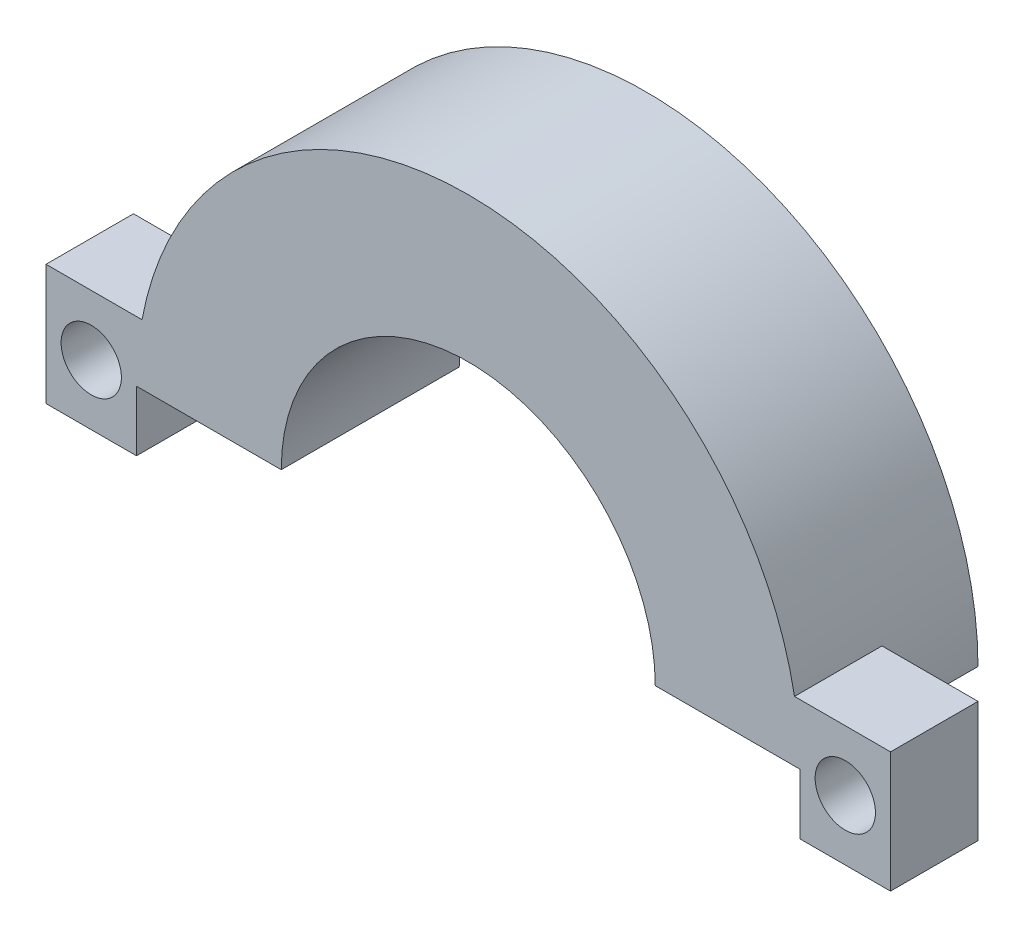
ISO-10303-21;
HEADER;
FILE_DESCRIPTION(('STEP AP214'),'2;1');
FILE_NAME('part.step','',(''),(''),'','','');
FILE_SCHEMA(('AUTOMOTIVE_DESIGN { 1 0 10303 214 1 1 1 1 }'));
ENDSEC;
DATA;
#1=APPLICATION_CONTEXT('core data for automotive mechanical design processes');
#2=APPLICATION_PROTOCOL_DEFINITION('international standard','automotive_design',2000,#1);
#3=PRODUCT_CONTEXT('',#1,'mechanical');
#4=PRODUCT('Part','Part','',(#3));
#5=PRODUCT_RELATED_PRODUCT_CATEGORY('part','',(#4));
#6=PRODUCT_DEFINITION_FORMATION('','',#4);
#7=PRODUCT_DEFINITION_CONTEXT('part definition',#1,'design');
#8=PRODUCT_DEFINITION('design','',#6,#7);
#9=PRODUCT_DEFINITION_SHAPE('','',#8);
#10=(LENGTH_UNIT() NAMED_UNIT(*) SI_UNIT(.MILLI.,.METRE.));
#11=(NAMED_UNIT(*) PLANE_ANGLE_UNIT() SI_UNIT($,.RADIAN.));
#12=(NAMED_UNIT(*) SI_UNIT($,.STERADIAN.) SOLID_ANGLE_UNIT());
#13=UNCERTAINTY_MEASURE_WITH_UNIT(LENGTH_MEASURE(1.E-05),#10,'distance_accuracy_value','');
#14=(GEOMETRIC_REPRESENTATION_CONTEXT(3) GLOBAL_UNCERTAINTY_ASSIGNED_CONTEXT((#13)) GLOBAL_UNIT_ASSIGNED_CONTEXT((#10,
#11,#12)) REPRESENTATION_CONTEXT('',''));
#15=CARTESIAN_POINT('',(0.,0.,0.));
#16=DIRECTION('',(0.,0.,1.));
#17=DIRECTION('',(1.,0.,0.));
#18=AXIS2_PLACEMENT_3D('',#15,#16,#17);
#19=CARTESIAN_POINT('',(7.56323897211495,0.,5.9));
#20=DIRECTION('',(0.,0.,-1.));
#21=DIRECTION('',(-1.,0.,0.));
#22=AXIS2_PLACEMENT_3D('',#19,#20,#21);
#23=CYLINDRICAL_SURFACE('',#22,11.);
#24=CARTESIAN_POINT('',(7.56323897211495,0.,5.9));
#25=DIRECTION('',(0.,0.,1.));
#26=DIRECTION('',(1.,0.,0.));
#27=AXIS2_PLACEMENT_3D('',#24,#25,#26);
#28=CIRCLE('',#27,11.);
#29=CARTESIAN_POINT('',(-3.25341485427702,2.,5.9));
#30=VERTEX_POINT('',#29);
#31=CARTESIAN_POINT('',(18.3798927985069,2.,5.9));
#32=VERTEX_POINT('',#31);
#33=EDGE_CURVE('E66',#30,#32,#28,.F.);
#34=ORIENTED_EDGE('',*,*,#33,.T.);
#35=DIRECTION('',(0.,0.,-1.));
#36=VECTOR('',#35,1.);
#37=CARTESIAN_POINT('',(18.3798927985069,2.,5.9));
#38=LINE('',#37,#36);
#39=CARTESIAN_POINT('',(18.3798927985069,2.,3.));
#40=VERTEX_POINT('',#39);
#41=EDGE_CURVE('E61',#32,#40,#38,.T.);
#42=ORIENTED_EDGE('',*,*,#41,.T.);
#43=CARTESIAN_POINT('',(7.56323897211495,0.,3.));
#44=DIRECTION('',(0.,0.,1.));
#45=DIRECTION('',(1.,0.,0.));
#46=AXIS2_PLACEMENT_3D('',#43,#44,#45);
#47=CIRCLE('',#46,11.);
#48=CARTESIAN_POINT('',(18.563238972115,0.,3.));
#49=VERTEX_POINT('',#48);
#50=EDGE_CURVE('E146',#40,#49,#47,.F.);
#51=ORIENTED_EDGE('',*,*,#50,.T.);
#52=DIRECTION('',(0.,0.,-1.));
#53=VECTOR('',#52,1.);
#54=CARTESIAN_POINT('',(18.563238972115,0.,5.9));
#55=LINE('',#54,#53);
#56=CARTESIAN_POINT('',(18.563238972115,0.,0.));
#57=VERTEX_POINT('',#56);
#58=EDGE_CURVE('E235',#49,#57,#55,.T.);
#59=ORIENTED_EDGE('',*,*,#58,.T.);
#60=CARTESIAN_POINT('',(7.56323897211495,0.,0.));
#61=DIRECTION('',(0.,0.,1.));
#62=DIRECTION('',(1.,0.,0.));
#63=AXIS2_PLACEMENT_3D('',#60,#61,#62);
#64=CIRCLE('',#63,11.);
#65=CARTESIAN_POINT('',(-3.43676102788505,0.,0.));
#66=VERTEX_POINT('',#65);
#67=EDGE_CURVE('E220',#66,#57,#64,.F.);
#68=ORIENTED_EDGE('',*,*,#67,.F.);
#69=DIRECTION('',(0.,0.,-1.));
#70=VECTOR('',#69,1.);
#71=CARTESIAN_POINT('',(-3.43676102788505,0.,5.9));
#72=LINE('',#71,#70);
#73=CARTESIAN_POINT('',(-3.43676102788505,0.,3.));
#74=VERTEX_POINT('',#73);
#75=EDGE_CURVE('E224',#74,#66,#72,.T.);
#76=ORIENTED_EDGE('',*,*,#75,.F.);
#77=CARTESIAN_POINT('',(7.56323897211495,0.,3.));
#78=DIRECTION('',(0.,0.,1.));
#79=DIRECTION('',(1.,0.,0.));
#80=AXIS2_PLACEMENT_3D('',#77,#78,#79);
#81=CIRCLE('',#80,11.);
#82=CARTESIAN_POINT('',(-3.25341485427702,2.,3.));
#83=VERTEX_POINT('',#82);
#84=EDGE_CURVE('E11',#74,#83,#81,.F.);
#85=ORIENTED_EDGE('',*,*,#84,.T.);
#86=DIRECTION('',(0.,0.,-1.));
#87=VECTOR('',#86,1.);
#88=CARTESIAN_POINT('',(-3.25341485427702,2.,5.9));
#89=LINE('',#88,#87);
#90=EDGE_CURVE('E211',#83,#30,#89,.F.);
#91=ORIENTED_EDGE('',*,*,#90,.T.);
#92=EDGE_LOOP('',(#34,#42,#51,#59,#68,#76,#85,#91));
#93=FACE_BOUND('',#92,.T.);
#94=ADVANCED_FACE('F44',(#93),#23,.T.);
#95=CARTESIAN_POINT('',(0.,0.,5.9));
#96=DIRECTION('',(0.,1.,0.));
#97=DIRECTION('',(0.,0.,1.));
#98=AXIS2_PLACEMENT_3D('',#95,#96,#97);
#99=PLANE('',#98);
#100=DIRECTION('',(0.,0.,-1.));
#101=VECTOR('',#100,1.);
#102=CARTESIAN_POINT('',(1.36323897211495,0.,5.9));
#103=LINE('',#102,#101);
#104=CARTESIAN_POINT('',(1.36323897211495,0.,5.9));
#105=VERTEX_POINT('',#104);
#106=CARTESIAN_POINT('',(1.36323897211495,0.,0.));
#107=VERTEX_POINT('',#106);
#108=EDGE_CURVE('E53',#105,#107,#103,.T.);
#109=ORIENTED_EDGE('',*,*,#108,.F.);
#110=DIRECTION('',(1.,0.,0.));
#111=VECTOR('',#110,1.);
#112=CARTESIAN_POINT('',(0.,0.,5.9));
#113=LINE('',#112,#111);
#114=CARTESIAN_POINT('',(-3.43676102788505,0.,5.9));
#115=VERTEX_POINT('',#114);
#116=EDGE_CURVE('E217',#115,#105,#113,.T.);
#117=ORIENTED_EDGE('',*,*,#116,.F.);
#118=EDGE_CURVE('E232',#115,#74,#72,.T.);
#119=ORIENTED_EDGE('',*,*,#118,.T.);
#120=ORIENTED_EDGE('',*,*,#75,.T.);
#121=DIRECTION('',(1.,0.,0.));
#122=VECTOR('',#121,1.);
#123=CARTESIAN_POINT('',(0.,0.,0.));
#124=LINE('',#123,#122);
#125=EDGE_CURVE('E216',#66,#107,#124,.T.);
#126=ORIENTED_EDGE('',*,*,#125,.T.);
#127=EDGE_LOOP('',(#109,#117,#119,#120,#126));
#128=FACE_BOUND('',#127,.T.);
#129=ADVANCED_FACE('F299',(#128),#99,.F.);
#130=CARTESIAN_POINT('',(7.56323897211495,0.,5.9));
#131=DIRECTION('',(0.,0.,-1.));
#132=DIRECTION('',(-1.,0.,0.));
#133=AXIS2_PLACEMENT_3D('',#130,#131,#132);
#134=CYLINDRICAL_SURFACE('',#133,6.2);
#135=CARTESIAN_POINT('',(7.56323897211495,0.,0.));
#136=DIRECTION('',(0.,0.,1.));
#137=DIRECTION('',(1.,0.,0.));
#138=AXIS2_PLACEMENT_3D('',#135,#136,#137);
#139=CIRCLE('',#138,6.2);
#140=CARTESIAN_POINT('',(13.763238972115,0.,0.));
#141=VERTEX_POINT('',#140);
#142=EDGE_CURVE('E227',#107,#141,#139,.F.);
#143=ORIENTED_EDGE('',*,*,#142,.T.);
#144=DIRECTION('',(0.,0.,-1.));
#145=VECTOR('',#144,1.);
#146=CARTESIAN_POINT('',(13.763238972115,0.,5.9));
#147=LINE('',#146,#145);
#148=CARTESIAN_POINT('',(13.763238972115,0.,5.9));
#149=VERTEX_POINT('',#148);
#150=EDGE_CURVE('E239',#149,#141,#147,.T.);
#151=ORIENTED_EDGE('',*,*,#150,.F.);
#152=CARTESIAN_POINT('',(7.56323897211495,0.,5.9));
#153=DIRECTION('',(0.,0.,1.));
#154=DIRECTION('',(1.,0.,0.));
#155=AXIS2_PLACEMENT_3D('',#152,#153,#154);
#156=CIRCLE('',#155,6.2);
#157=EDGE_CURVE('E219',#105,#149,#156,.F.);
#158=ORIENTED_EDGE('',*,*,#157,.F.);
#159=ORIENTED_EDGE('',*,*,#108,.T.);
#160=EDGE_LOOP('',(#143,#151,#158,#159));
#161=FACE_BOUND('',#160,.T.);
#162=ADVANCED_FACE('F46',(#161),#134,.F.);
#163=CARTESIAN_POINT('',(18.563238972115,0.,5.9));
#164=VERTEX_POINT('',#163);
#165=EDGE_CURVE('E236',#164,#49,#55,.T.);
#166=ORIENTED_EDGE('',*,*,#165,.F.);
#167=EDGE_CURVE('E221',#149,#164,#113,.T.);
#168=ORIENTED_EDGE('',*,*,#167,.F.);
#169=ORIENTED_EDGE('',*,*,#150,.T.);
#170=EDGE_CURVE('E228',#141,#57,#124,.T.);
#171=ORIENTED_EDGE('',*,*,#170,.T.);
#172=ORIENTED_EDGE('',*,*,#58,.F.);
#173=EDGE_LOOP('',(#166,#168,#169,#171,#172));
#174=FACE_BOUND('',#173,.T.);
#175=ADVANCED_FACE('F262',(#174),#99,.F.);
#176=CARTESIAN_POINT('',(0.,0.,5.9));
#177=DIRECTION('',(0.,0.,1.));
#178=DIRECTION('',(1.,0.,0.));
#179=AXIS2_PLACEMENT_3D('',#176,#177,#178);
#180=PLANE('',#179);
#181=CARTESIAN_POINT('',(20.063238972115,0.,5.9));
#182=DIRECTION('',(0.,0.,1.));
#183=DIRECTION('',(1.,0.,0.));
#184=AXIS2_PLACEMENT_3D('',#181,#182,#183);
#185=CIRCLE('',#184,1.);
#186=CARTESIAN_POINT('',(21.063238972115,0.,5.9));
#187=VERTEX_POINT('',#186);
#188=EDGE_CURVE('E245',#187,#187,#185,.T.);
#189=ORIENTED_EDGE('',*,*,#188,.F.);
#190=EDGE_LOOP('',(#189));
#191=FACE_BOUND('',#190,.T.);
#192=CARTESIAN_POINT('',(-4.93676102788505,0.,5.9));
#193=DIRECTION('',(0.,0.,1.));
#194=DIRECTION('',(1.,0.,0.));
#195=AXIS2_PLACEMENT_3D('',#192,#193,#194);
#196=CIRCLE('',#195,1.);
#197=CARTESIAN_POINT('',(-3.93676102788505,0.,5.9));
#198=VERTEX_POINT('',#197);
#199=EDGE_CURVE('E170',#198,#198,#196,.T.);
#200=ORIENTED_EDGE('',*,*,#199,.F.);
#201=EDGE_LOOP('',(#200));
#202=FACE_BOUND('',#201,.T.);
#203=ORIENTED_EDGE('',*,*,#167,.T.);
#204=DIRECTION('',(0.,-1.,0.));
#205=VECTOR('',#204,1.);
#206=CARTESIAN_POINT('',(18.563238972115,0.,5.9));
#207=LINE('',#206,#205);
#208=CARTESIAN_POINT('',(18.563238972115,-2.,5.9));
#209=VERTEX_POINT('',#208);
#210=EDGE_CURVE('E167',#164,#209,#207,.T.);
#211=ORIENTED_EDGE('',*,*,#210,.T.);
#212=DIRECTION('',(1.,0.,0.));
#213=VECTOR('',#212,1.);
#214=CARTESIAN_POINT('',(0.,-2.,5.9));
#215=LINE('',#214,#213);
#216=CARTESIAN_POINT('',(21.563238972115,-2.,5.9));
#217=VERTEX_POINT('',#216);
#218=EDGE_CURVE('E164',#209,#217,#215,.T.);
#219=ORIENTED_EDGE('',*,*,#218,.T.);
#220=DIRECTION('',(0.,-1.,0.));
#221=VECTOR('',#220,1.);
#222=CARTESIAN_POINT('',(21.563238972115,0.,5.9));
#223=LINE('',#222,#221);
#224=CARTESIAN_POINT('',(21.563238972115,2.,5.9));
#225=VERTEX_POINT('',#224);
#226=EDGE_CURVE('E176',#225,#217,#223,.T.);
#227=ORIENTED_EDGE('',*,*,#226,.F.);
#228=DIRECTION('',(1.,0.,0.));
#229=VECTOR('',#228,1.);
#230=CARTESIAN_POINT('',(0.,2.,5.9));
#231=LINE('',#230,#229);
#232=EDGE_CURVE('E154',#32,#225,#231,.T.);
#233=ORIENTED_EDGE('',*,*,#232,.F.);
#234=ORIENTED_EDGE('',*,*,#33,.F.);
#235=DIRECTION('',(1.,0.,0.));
#236=VECTOR('',#235,1.);
#237=CARTESIAN_POINT('',(0.,2.,5.9));
#238=LINE('',#237,#236);
#239=CARTESIAN_POINT('',(-6.43676102788505,2.,5.9));
#240=VERTEX_POINT('',#239);
#241=EDGE_CURVE('E190',#240,#30,#238,.T.);
#242=ORIENTED_EDGE('',*,*,#241,.F.);
#243=DIRECTION('',(0.,-1.,0.));
#244=VECTOR('',#243,1.);
#245=CARTESIAN_POINT('',(-6.43676102788505,0.,5.9));
#246=LINE('',#245,#244);
#247=CARTESIAN_POINT('',(-6.43676102788505,-2.,5.9));
#248=VERTEX_POINT('',#247);
#249=EDGE_CURVE('E185',#240,#248,#246,.T.);
#250=ORIENTED_EDGE('',*,*,#249,.T.);
#251=DIRECTION('',(1.,0.,0.));
#252=VECTOR('',#251,1.);
#253=CARTESIAN_POINT('',(0.,-2.,5.9));
#254=LINE('',#253,#252);
#255=CARTESIAN_POINT('',(-3.43676102788505,-2.,5.9));
#256=VERTEX_POINT('',#255);
#257=EDGE_CURVE('E201',#248,#256,#254,.T.);
#258=ORIENTED_EDGE('',*,*,#257,.T.);
#259=DIRECTION('',(0.,-1.,0.));
#260=VECTOR('',#259,1.);
#261=CARTESIAN_POINT('',(-3.43676102788505,0.,5.9));
#262=LINE('',#261,#260);
#263=EDGE_CURVE('E204',#115,#256,#262,.T.);
#264=ORIENTED_EDGE('',*,*,#263,.F.);
#265=ORIENTED_EDGE('',*,*,#116,.T.);
#266=ORIENTED_EDGE('',*,*,#157,.T.);
#267=EDGE_LOOP('',(#203,#211,#219,#227,#233,#234,#242,#250,#258,#264,#265,#266));
#268=FACE_BOUND('',#267,.T.);
#269=ADVANCED_FACE('F258',(#191,#202,#268),#180,.T.);
#270=CARTESIAN_POINT('',(0.,0.,0.));
#271=DIRECTION('',(0.,0.,1.));
#272=DIRECTION('',(1.,0.,0.));
#273=AXIS2_PLACEMENT_3D('',#270,#271,#272);
#274=PLANE('',#273);
#275=ORIENTED_EDGE('',*,*,#125,.F.);
#276=ORIENTED_EDGE('',*,*,#67,.T.);
#277=ORIENTED_EDGE('',*,*,#170,.F.);
#278=ORIENTED_EDGE('',*,*,#142,.F.);
#279=EDGE_LOOP('',(#275,#276,#277,#278));
#280=FACE_BOUND('',#279,.T.);
#281=ADVANCED_FACE('F261',(#280),#274,.F.);
#282=CARTESIAN_POINT('',(-6.43676102788505,0.,3.));
#283=DIRECTION('',(-1.,0.,0.));
#284=DIRECTION('',(0.,0.,1.));
#285=AXIS2_PLACEMENT_3D('',#282,#283,#284);
#286=PLANE('',#285);
#287=ORIENTED_EDGE('',*,*,#249,.F.);
#288=DIRECTION('',(0.,0.,1.));
#289=VECTOR('',#288,1.);
#290=CARTESIAN_POINT('',(-6.43676102788505,2.,3.));
#291=LINE('',#290,#289);
#292=CARTESIAN_POINT('',(-6.43676102788505,2.,3.));
#293=VERTEX_POINT('',#292);
#294=EDGE_CURVE('E209',#293,#240,#291,.T.);
#295=ORIENTED_EDGE('',*,*,#294,.F.);
#296=DIRECTION('',(0.,-1.,0.));
#297=VECTOR('',#296,1.);
#298=CARTESIAN_POINT('',(-6.43676102788505,0.,3.));
#299=LINE('',#298,#297);
#300=CARTESIAN_POINT('',(-6.43676102788505,-2.,3.));
#301=VERTEX_POINT('',#300);
#302=EDGE_CURVE('E186',#293,#301,#299,.T.);
#303=ORIENTED_EDGE('',*,*,#302,.T.);
#304=DIRECTION('',(0.,0.,1.));
#305=VECTOR('',#304,1.);
#306=CARTESIAN_POINT('',(-6.43676102788505,-2.,3.));
#307=LINE('',#306,#305);
#308=EDGE_CURVE('E198',#301,#248,#307,.T.);
#309=ORIENTED_EDGE('',*,*,#308,.T.);
#310=EDGE_LOOP('',(#287,#295,#303,#309));
#311=FACE_BOUND('',#310,.T.);
#312=ADVANCED_FACE('F286',(#311),#286,.T.);
#313=CARTESIAN_POINT('',(0.,2.,3.));
#314=DIRECTION('',(0.,-1.,0.));
#315=DIRECTION('',(0.,0.,-1.));
#316=AXIS2_PLACEMENT_3D('',#313,#314,#315);
#317=PLANE('',#316);
#318=ORIENTED_EDGE('',*,*,#90,.F.);
#319=DIRECTION('',(1.,0.,0.));
#320=VECTOR('',#319,1.);
#321=CARTESIAN_POINT('',(0.,2.,3.));
#322=LINE('',#321,#320);
#323=EDGE_CURVE('E195',#293,#83,#322,.T.);
#324=ORIENTED_EDGE('',*,*,#323,.F.);
#325=ORIENTED_EDGE('',*,*,#294,.T.);
#326=ORIENTED_EDGE('',*,*,#241,.T.);
#327=EDGE_LOOP('',(#318,#324,#325,#326));
#328=FACE_BOUND('',#327,.T.);
#329=ADVANCED_FACE('F283',(#328),#317,.F.);
#330=CARTESIAN_POINT('',(-3.43676102788505,0.,3.));
#331=DIRECTION('',(-1.,0.,0.));
#332=DIRECTION('',(0.,-1.,0.));
#333=AXIS2_PLACEMENT_3D('',#330,#331,#332);
#334=PLANE('',#333);
#335=ORIENTED_EDGE('',*,*,#263,.T.);
#336=DIRECTION('',(0.,0.,1.));
#337=VECTOR('',#336,1.);
#338=CARTESIAN_POINT('',(-3.43676102788505,-2.,3.));
#339=LINE('',#338,#337);
#340=CARTESIAN_POINT('',(-3.43676102788505,-2.,3.));
#341=VERTEX_POINT('',#340);
#342=EDGE_CURVE('E212',#341,#256,#339,.T.);
#343=ORIENTED_EDGE('',*,*,#342,.F.);
#344=DIRECTION('',(0.,-1.,0.));
#345=VECTOR('',#344,1.);
#346=CARTESIAN_POINT('',(-3.43676102788505,0.,3.));
#347=LINE('',#346,#345);
#348=EDGE_CURVE('E193',#74,#341,#347,.T.);
#349=ORIENTED_EDGE('',*,*,#348,.F.);
#350=ORIENTED_EDGE('',*,*,#118,.F.);
#351=EDGE_LOOP('',(#335,#343,#349,#350));
#352=FACE_BOUND('',#351,.T.);
#353=ADVANCED_FACE('F296',(#352),#334,.F.);
#354=CARTESIAN_POINT('',(0.,-2.,3.));
#355=DIRECTION('',(0.,-1.,0.));
#356=DIRECTION('',(0.,0.,-1.));
#357=AXIS2_PLACEMENT_3D('',#354,#355,#356);
#358=PLANE('',#357);
#359=ORIENTED_EDGE('',*,*,#257,.F.);
#360=ORIENTED_EDGE('',*,*,#308,.F.);
#361=DIRECTION('',(1.,0.,0.));
#362=VECTOR('',#361,1.);
#363=CARTESIAN_POINT('',(0.,-2.,3.));
#364=LINE('',#363,#362);
#365=EDGE_CURVE('E189',#301,#341,#364,.T.);
#366=ORIENTED_EDGE('',*,*,#365,.T.);
#367=ORIENTED_EDGE('',*,*,#342,.T.);
#368=EDGE_LOOP('',(#359,#360,#366,#367));
#369=FACE_BOUND('',#368,.T.);
#370=ADVANCED_FACE('F290',(#369),#358,.T.);
#371=CARTESIAN_POINT('',(0.,0.,3.));
#372=DIRECTION('',(0.,0.,1.));
#373=DIRECTION('',(1.,0.,0.));
#374=AXIS2_PLACEMENT_3D('',#371,#372,#373);
#375=PLANE('',#374);
#376=CARTESIAN_POINT('',(-4.93676102788505,0.,3.));
#377=DIRECTION('',(0.,0.,1.));
#378=DIRECTION('',(1.,0.,0.));
#379=AXIS2_PLACEMENT_3D('',#376,#377,#378);
#380=CIRCLE('',#379,1.);
#381=CARTESIAN_POINT('',(-3.93676102788505,0.,3.));
#382=VERTEX_POINT('',#381);
#383=EDGE_CURVE('E48',#382,#382,#380,.T.);
#384=ORIENTED_EDGE('',*,*,#383,.T.);
#385=EDGE_LOOP('',(#384));
#386=FACE_BOUND('',#385,.T.);
#387=ORIENTED_EDGE('',*,*,#84,.F.);
#388=ORIENTED_EDGE('',*,*,#348,.T.);
#389=ORIENTED_EDGE('',*,*,#365,.F.);
#390=ORIENTED_EDGE('',*,*,#302,.F.);
#391=ORIENTED_EDGE('',*,*,#323,.T.);
#392=EDGE_LOOP('',(#387,#388,#389,#390,#391));
#393=FACE_BOUND('',#392,.T.);
#394=ADVANCED_FACE('F302',(#386,#393),#375,.F.);
#395=CARTESIAN_POINT('',(21.563238972115,0.,3.));
#396=DIRECTION('',(-1.,0.,0.));
#397=DIRECTION('',(0.,0.,1.));
#398=AXIS2_PLACEMENT_3D('',#395,#396,#397);
#399=PLANE('',#398);
#400=ORIENTED_EDGE('',*,*,#226,.T.);
#401=DIRECTION('',(0.,0.,1.));
#402=VECTOR('',#401,1.);
#403=CARTESIAN_POINT('',(21.563238972115,-2.,3.));
#404=LINE('',#403,#402);
#405=CARTESIAN_POINT('',(21.563238972115,-2.,3.));
#406=VERTEX_POINT('',#405);
#407=EDGE_CURVE('E162',#406,#217,#404,.T.);
#408=ORIENTED_EDGE('',*,*,#407,.F.);
#409=DIRECTION('',(0.,-1.,0.));
#410=VECTOR('',#409,1.);
#411=CARTESIAN_POINT('',(21.563238972115,0.,3.));
#412=LINE('',#411,#410);
#413=CARTESIAN_POINT('',(21.563238972115,2.,3.));
#414=VERTEX_POINT('',#413);
#415=EDGE_CURVE('E143',#414,#406,#412,.T.);
#416=ORIENTED_EDGE('',*,*,#415,.F.);
#417=DIRECTION('',(0.,0.,1.));
#418=VECTOR('',#417,1.);
#419=CARTESIAN_POINT('',(21.563238972115,2.,3.));
#420=LINE('',#419,#418);
#421=EDGE_CURVE('E151',#414,#225,#420,.T.);
#422=ORIENTED_EDGE('',*,*,#421,.T.);
#423=EDGE_LOOP('',(#400,#408,#416,#422));
#424=FACE_BOUND('',#423,.T.);
#425=ADVANCED_FACE('F161',(#424),#399,.F.);
#426=CARTESIAN_POINT('',(0.,-2.,3.));
#427=DIRECTION('',(0.,-1.,0.));
#428=DIRECTION('',(0.,0.,-1.));
#429=AXIS2_PLACEMENT_3D('',#426,#427,#428);
#430=PLANE('',#429);
#431=ORIENTED_EDGE('',*,*,#218,.F.);
#432=DIRECTION('',(0.,0.,1.));
#433=VECTOR('',#432,1.);
#434=CARTESIAN_POINT('',(18.563238972115,-2.,3.));
#435=LINE('',#434,#433);
#436=CARTESIAN_POINT('',(18.563238972115,-2.,3.));
#437=VERTEX_POINT('',#436);
#438=EDGE_CURVE('E158',#437,#209,#435,.T.);
#439=ORIENTED_EDGE('',*,*,#438,.F.);
#440=DIRECTION('',(1.,0.,0.));
#441=VECTOR('',#440,1.);
#442=CARTESIAN_POINT('',(0.,-2.,3.));
#443=LINE('',#442,#441);
#444=EDGE_CURVE('E159',#437,#406,#443,.T.);
#445=ORIENTED_EDGE('',*,*,#444,.T.);
#446=ORIENTED_EDGE('',*,*,#407,.T.);
#447=EDGE_LOOP('',(#431,#439,#445,#446));
#448=FACE_BOUND('',#447,.T.);
#449=ADVANCED_FACE('F276',(#448),#430,.T.);
#450=CARTESIAN_POINT('',(18.563238972115,0.,3.));
#451=DIRECTION('',(-1.,0.,0.));
#452=DIRECTION('',(0.,0.,1.));
#453=AXIS2_PLACEMENT_3D('',#450,#451,#452);
#454=PLANE('',#453);
#455=ORIENTED_EDGE('',*,*,#210,.F.);
#456=ORIENTED_EDGE('',*,*,#165,.T.);
#457=DIRECTION('',(0.,-1.,0.));
#458=VECTOR('',#457,1.);
#459=CARTESIAN_POINT('',(18.563238972115,0.,3.));
#460=LINE('',#459,#458);
#461=EDGE_CURVE('E148',#49,#437,#460,.T.);
#462=ORIENTED_EDGE('',*,*,#461,.T.);
#463=ORIENTED_EDGE('',*,*,#438,.T.);
#464=EDGE_LOOP('',(#455,#456,#462,#463));
#465=FACE_BOUND('',#464,.T.);
#466=ADVANCED_FACE('F274',(#465),#454,.T.);
#467=CARTESIAN_POINT('',(0.,2.,3.));
#468=DIRECTION('',(0.,-1.,0.));
#469=DIRECTION('',(1.,0.,0.));
#470=AXIS2_PLACEMENT_3D('',#467,#468,#469);
#471=PLANE('',#470);
#472=ORIENTED_EDGE('',*,*,#41,.F.);
#473=ORIENTED_EDGE('',*,*,#232,.T.);
#474=ORIENTED_EDGE('',*,*,#421,.F.);
#475=DIRECTION('',(1.,0.,0.));
#476=VECTOR('',#475,1.);
#477=CARTESIAN_POINT('',(0.,2.,3.));
#478=LINE('',#477,#476);
#479=EDGE_CURVE('E138',#40,#414,#478,.T.);
#480=ORIENTED_EDGE('',*,*,#479,.F.);
#481=EDGE_LOOP('',(#472,#473,#474,#480));
#482=FACE_BOUND('',#481,.T.);
#483=ADVANCED_FACE('F152',(#482),#471,.F.);
#484=CARTESIAN_POINT('',(0.,0.,3.));
#485=DIRECTION('',(0.,0.,1.));
#486=DIRECTION('',(1.,0.,0.));
#487=AXIS2_PLACEMENT_3D('',#484,#485,#486);
#488=PLANE('',#487);
#489=CARTESIAN_POINT('',(20.063238972115,0.,3.));
#490=DIRECTION('',(0.,0.,1.));
#491=DIRECTION('',(1.,0.,0.));
#492=AXIS2_PLACEMENT_3D('',#489,#490,#491);
#493=CIRCLE('',#492,1.);
#494=CARTESIAN_POINT('',(21.063238972115,0.,3.));
#495=VERTEX_POINT('',#494);
#496=EDGE_CURVE('E243',#495,#495,#493,.T.);
#497=ORIENTED_EDGE('',*,*,#496,.T.);
#498=EDGE_LOOP('',(#497));
#499=FACE_BOUND('',#498,.T.);
#500=ORIENTED_EDGE('',*,*,#50,.F.);
#501=ORIENTED_EDGE('',*,*,#479,.T.);
#502=ORIENTED_EDGE('',*,*,#415,.T.);
#503=ORIENTED_EDGE('',*,*,#444,.F.);
#504=ORIENTED_EDGE('',*,*,#461,.F.);
#505=EDGE_LOOP('',(#500,#501,#502,#503,#504));
#506=FACE_BOUND('',#505,.T.);
#507=ADVANCED_FACE('F140',(#499,#506),#488,.F.);
#508=CARTESIAN_POINT('',(20.063238972115,0.,-0.6));
#509=DIRECTION('',(0.,0.,1.));
#510=DIRECTION('',(1.,0.,0.));
#511=AXIS2_PLACEMENT_3D('',#508,#509,#510);
#512=CYLINDRICAL_SURFACE('',#511,1.);
#513=ORIENTED_EDGE('',*,*,#188,.T.);
#514=EDGE_LOOP('',(#513));
#515=FACE_BOUND('',#514,.T.);
#516=ORIENTED_EDGE('',*,*,#496,.F.);
#517=EDGE_LOOP('',(#516));
#518=FACE_BOUND('',#517,.T.);
#519=ADVANCED_FACE('F405',(#515,#518),#512,.F.);
#520=CARTESIAN_POINT('',(-4.93676102788505,0.,-0.6));
#521=DIRECTION('',(0.,0.,1.));
#522=DIRECTION('',(1.,0.,0.));
#523=AXIS2_PLACEMENT_3D('',#520,#521,#522);
#524=CYLINDRICAL_SURFACE('',#523,1.);
#525=ORIENTED_EDGE('',*,*,#199,.T.);
#526=EDGE_LOOP('',(#525));
#527=FACE_BOUND('',#526,.T.);
#528=ORIENTED_EDGE('',*,*,#383,.F.);
#529=EDGE_LOOP('',(#528));
#530=FACE_BOUND('',#529,.T.);
#531=ADVANCED_FACE('F255',(#527,#530),#524,.F.);
#532=CLOSED_SHELL('',(#94,#129,#162,#175,#269,#281,#312,#329,#353,#370,#394,#425,#449,#466,#483,
#507,#519,#531));
#533=MANIFOLD_SOLID_BREP('B2',#532);
#534=ADVANCED_BREP_SHAPE_REPRESENTATION('',(#18,#533),#14);
#535=SHAPE_DEFINITION_REPRESENTATION(#9,#534);
ENDSEC;
END-ISO-10303-21;
